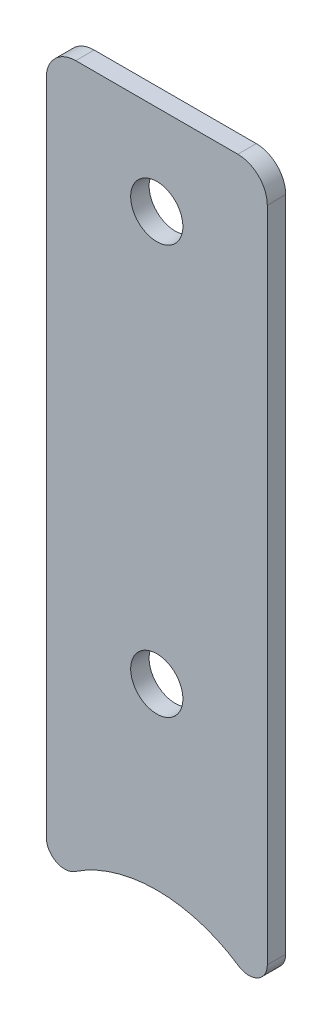
ISO-10303-21;
HEADER;
FILE_DESCRIPTION(('STEP AP214'),'2;1');
FILE_NAME('part.step','',(''),(''),'','','');
FILE_SCHEMA(('AUTOMOTIVE_DESIGN { 1 0 10303 214 1 1 1 1 }'));
ENDSEC;
DATA;
#1=APPLICATION_CONTEXT('core data for automotive mechanical design processes');
#2=APPLICATION_PROTOCOL_DEFINITION('international standard','automotive_design',2000,#1);
#3=PRODUCT_CONTEXT('',#1,'mechanical');
#4=PRODUCT('Part','Part','',(#3));
#5=PRODUCT_RELATED_PRODUCT_CATEGORY('part','',(#4));
#6=PRODUCT_DEFINITION_FORMATION('','',#4);
#7=PRODUCT_DEFINITION_CONTEXT('part definition',#1,'design');
#8=PRODUCT_DEFINITION('design','',#6,#7);
#9=PRODUCT_DEFINITION_SHAPE('','',#8);
#10=(LENGTH_UNIT() NAMED_UNIT(*) SI_UNIT(.MILLI.,.METRE.));
#11=(NAMED_UNIT(*) PLANE_ANGLE_UNIT() SI_UNIT($,.RADIAN.));
#12=(NAMED_UNIT(*) SI_UNIT($,.STERADIAN.) SOLID_ANGLE_UNIT());
#13=UNCERTAINTY_MEASURE_WITH_UNIT(LENGTH_MEASURE(1.E-05),#10,'distance_accuracy_value','');
#14=(GEOMETRIC_REPRESENTATION_CONTEXT(3) GLOBAL_UNCERTAINTY_ASSIGNED_CONTEXT((#13)) GLOBAL_UNIT_ASSIGNED_CONTEXT((#10,
#11,#12)) REPRESENTATION_CONTEXT('',''));
#15=CARTESIAN_POINT('',(0.,0.,0.));
#16=DIRECTION('',(0.,0.,1.));
#17=DIRECTION('',(1.,0.,0.));
#18=AXIS2_PLACEMENT_3D('',#15,#16,#17);
#19=CARTESIAN_POINT('',(9.525,0.,1.5875));
#20=DIRECTION('',(1.,0.,0.));
#21=DIRECTION('',(0.,1.,0.));
#22=AXIS2_PLACEMENT_3D('',#19,#20,#21);
#23=PLANE('',#22);
#24=DIRECTION('',(0.,-1.,0.));
#25=VECTOR('',#24,1.);
#26=CARTESIAN_POINT('',(9.525,0.,1.5875));
#27=LINE('',#26,#25);
#28=CARTESIAN_POINT('',(9.525,22.86,1.5875));
#29=VERTEX_POINT('',#28);
#30=CARTESIAN_POINT('',(9.52500000000001,-33.8402377969927,1.5875));
#31=VERTEX_POINT('',#30);
#32=EDGE_CURVE('E145',#29,#31,#27,.T.);
#33=ORIENTED_EDGE('',*,*,#32,.T.);
#34=DIRECTION('',(0.,0.,-1.));
#35=VECTOR('',#34,1.);
#36=CARTESIAN_POINT('',(9.52500000000001,-33.8402377969927,0.));
#37=LINE('',#36,#35);
#38=CARTESIAN_POINT('',(9.52500000000001,-33.8402377969927,0.));
#39=VERTEX_POINT('',#38);
#40=EDGE_CURVE('E79',#31,#39,#37,.T.);
#41=ORIENTED_EDGE('',*,*,#40,.T.);
#42=DIRECTION('',(0.,-1.,0.));
#43=VECTOR('',#42,1.);
#44=CARTESIAN_POINT('',(9.525,0.,0.));
#45=LINE('',#44,#43);
#46=CARTESIAN_POINT('',(9.525,22.86,0.));
#47=VERTEX_POINT('',#46);
#48=EDGE_CURVE('E150',#47,#39,#45,.T.);
#49=ORIENTED_EDGE('',*,*,#48,.F.);
#50=DIRECTION('',(0.,0.,-1.));
#51=VECTOR('',#50,1.);
#52=CARTESIAN_POINT('',(9.525,22.86,1.5875));
#53=LINE('',#52,#51);
#54=EDGE_CURVE('E162',#47,#29,#53,.F.);
#55=ORIENTED_EDGE('',*,*,#54,.T.);
#56=EDGE_LOOP('',(#33,#41,#49,#55));
#57=FACE_BOUND('',#56,.T.);
#58=ADVANCED_FACE('F56',(#57),#23,.T.);
#59=CARTESIAN_POINT('',(0.,25.4,1.5875));
#60=DIRECTION('',(0.,1.,0.));
#61=DIRECTION('',(-1.,0.,0.));
#62=AXIS2_PLACEMENT_3D('',#59,#60,#61);
#63=PLANE('',#62);
#64=DIRECTION('',(1.,0.,0.));
#65=VECTOR('',#64,1.);
#66=CARTESIAN_POINT('',(0.,25.4,0.));
#67=LINE('',#66,#65);
#68=CARTESIAN_POINT('',(-6.985,25.4,0.));
#69=VERTEX_POINT('',#68);
#70=CARTESIAN_POINT('',(6.985,25.4,0.));
#71=VERTEX_POINT('',#70);
#72=EDGE_CURVE('E146',#69,#71,#67,.T.);
#73=ORIENTED_EDGE('',*,*,#72,.F.);
#74=DIRECTION('',(0.,0.,-1.));
#75=VECTOR('',#74,1.);
#76=CARTESIAN_POINT('',(-6.985,25.4,1.5875));
#77=LINE('',#76,#75);
#78=CARTESIAN_POINT('',(-6.985,25.4,1.5875));
#79=VERTEX_POINT('',#78);
#80=EDGE_CURVE('E130',#69,#79,#77,.F.);
#81=ORIENTED_EDGE('',*,*,#80,.T.);
#82=DIRECTION('',(1.,0.,0.));
#83=VECTOR('',#82,1.);
#84=CARTESIAN_POINT('',(0.,25.4,1.5875));
#85=LINE('',#84,#83);
#86=CARTESIAN_POINT('',(6.985,25.4,1.5875));
#87=VERTEX_POINT('',#86);
#88=EDGE_CURVE('E148',#79,#87,#85,.T.);
#89=ORIENTED_EDGE('',*,*,#88,.T.);
#90=DIRECTION('',(0.,0.,-1.));
#91=VECTOR('',#90,1.);
#92=CARTESIAN_POINT('',(6.985,25.4,1.5875));
#93=LINE('',#92,#91);
#94=EDGE_CURVE('E133',#87,#71,#93,.T.);
#95=ORIENTED_EDGE('',*,*,#94,.T.);
#96=EDGE_LOOP('',(#73,#81,#89,#95));
#97=FACE_BOUND('',#96,.T.);
#98=ADVANCED_FACE('F199',(#97),#63,.T.);
#99=CARTESIAN_POINT('',(-9.525,0.,1.5875));
#100=DIRECTION('',(1.,0.,0.));
#101=DIRECTION('',(0.,1.,0.));
#102=AXIS2_PLACEMENT_3D('',#99,#100,#101);
#103=PLANE('',#102);
#104=DIRECTION('',(0.,-1.,0.));
#105=VECTOR('',#104,1.);
#106=CARTESIAN_POINT('',(-9.525,0.,0.));
#107=LINE('',#106,#105);
#108=CARTESIAN_POINT('',(-9.525,22.86,0.));
#109=VERTEX_POINT('',#108);
#110=CARTESIAN_POINT('',(-9.525,-33.8402377969927,0.));
#111=VERTEX_POINT('',#110);
#112=EDGE_CURVE('E139',#109,#111,#107,.T.);
#113=ORIENTED_EDGE('',*,*,#112,.T.);
#114=DIRECTION('',(0.,0.,1.));
#115=VECTOR('',#114,1.);
#116=CARTESIAN_POINT('',(-9.525,-33.8402377969927,1.5875));
#117=LINE('',#116,#115);
#118=CARTESIAN_POINT('',(-9.525,-33.8402377969927,1.5875));
#119=VERTEX_POINT('',#118);
#120=EDGE_CURVE('E12',#111,#119,#117,.T.);
#121=ORIENTED_EDGE('',*,*,#120,.T.);
#122=DIRECTION('',(0.,-1.,0.));
#123=VECTOR('',#122,1.);
#124=CARTESIAN_POINT('',(-9.525,0.,1.5875));
#125=LINE('',#124,#123);
#126=CARTESIAN_POINT('',(-9.525,22.86,1.5875));
#127=VERTEX_POINT('',#126);
#128=EDGE_CURVE('E142',#127,#119,#125,.T.);
#129=ORIENTED_EDGE('',*,*,#128,.F.);
#130=DIRECTION('',(0.,0.,-1.));
#131=VECTOR('',#130,1.);
#132=CARTESIAN_POINT('',(-9.525,22.86,0.));
#133=LINE('',#132,#131);
#134=EDGE_CURVE('E129',#127,#109,#133,.T.);
#135=ORIENTED_EDGE('',*,*,#134,.T.);
#136=EDGE_LOOP('',(#113,#121,#129,#135));
#137=FACE_BOUND('',#136,.T.);
#138=ADVANCED_FACE('F138',(#137),#103,.F.);
#139=CARTESIAN_POINT('',(0.,0.,1.5875));
#140=DIRECTION('',(0.,0.,1.));
#141=DIRECTION('',(1.,0.,0.));
#142=AXIS2_PLACEMENT_3D('',#139,#140,#141);
#143=PLANE('',#142);
#144=CARTESIAN_POINT('',(0.,17.6276,1.5875));
#145=DIRECTION('',(0.,0.,1.));
#146=DIRECTION('',(1.,0.,0.));
#147=AXIS2_PLACEMENT_3D('',#144,#145,#146);
#148=CIRCLE('',#147,2.24999999999999);
#149=CARTESIAN_POINT('',(2.24999999999999,17.6276,1.5875));
#150=VERTEX_POINT('',#149);
#151=EDGE_CURVE('E184',#150,#150,#148,.T.);
#152=ORIENTED_EDGE('',*,*,#151,.F.);
#153=EDGE_LOOP('',(#152));
#154=FACE_BOUND('',#153,.T.);
#155=CARTESIAN_POINT('',(0.,-17.6276,1.5875));
#156=DIRECTION('',(0.,0.,1.));
#157=DIRECTION('',(1.,0.,0.));
#158=AXIS2_PLACEMENT_3D('',#155,#156,#157);
#159=CIRCLE('',#158,2.24999999999999);
#160=CARTESIAN_POINT('',(2.24999999999999,-17.6276,1.5875));
#161=VERTEX_POINT('',#160);
#162=EDGE_CURVE('E205',#161,#161,#159,.T.);
#163=ORIENTED_EDGE('',*,*,#162,.F.);
#164=EDGE_LOOP('',(#163));
#165=FACE_BOUND('',#164,.T.);
#166=CARTESIAN_POINT('',(0.,-45.72,1.5875));
#167=DIRECTION('',(0.,0.,1.));
#168=DIRECTION('',(1.,0.,0.));
#169=AXIS2_PLACEMENT_3D('',#166,#167,#168);
#170=CIRCLE('',#169,12.7);
#171=CARTESIAN_POINT('',(7.05555555555556,-35.1602113751047,1.5875));
#172=VERTEX_POINT('',#171);
#173=CARTESIAN_POINT('',(-7.05555555555556,-35.1602113751047,1.5875));
#174=VERTEX_POINT('',#173);
#175=EDGE_CURVE('E185',#172,#174,#170,.T.);
#176=ORIENTED_EDGE('',*,*,#175,.F.);
#177=CARTESIAN_POINT('',(7.93750000000001,-33.8402377969927,1.5875));
#178=DIRECTION('',(0.,0.,1.));
#179=DIRECTION('',(1.,0.,0.));
#180=AXIS2_PLACEMENT_3D('',#177,#178,#179);
#181=CIRCLE('',#180,1.5875);
#182=EDGE_CURVE('E171',#172,#31,#181,.T.);
#183=ORIENTED_EDGE('',*,*,#182,.T.);
#184=ORIENTED_EDGE('',*,*,#32,.F.);
#185=CARTESIAN_POINT('',(6.985,22.86,1.5875));
#186=DIRECTION('',(0.,0.,1.));
#187=DIRECTION('',(1.,0.,0.));
#188=AXIS2_PLACEMENT_3D('',#185,#186,#187);
#189=CIRCLE('',#188,2.54);
#190=EDGE_CURVE('E158',#29,#87,#189,.T.);
#191=ORIENTED_EDGE('',*,*,#190,.T.);
#192=ORIENTED_EDGE('',*,*,#88,.F.);
#193=CARTESIAN_POINT('',(-6.985,22.86,1.5875));
#194=DIRECTION('',(0.,0.,1.));
#195=DIRECTION('',(1.,0.,0.));
#196=AXIS2_PLACEMENT_3D('',#193,#194,#195);
#197=CIRCLE('',#196,2.54);
#198=EDGE_CURVE('E160',#79,#127,#197,.T.);
#199=ORIENTED_EDGE('',*,*,#198,.T.);
#200=ORIENTED_EDGE('',*,*,#128,.T.);
#201=CARTESIAN_POINT('',(-7.9375,-33.8402377969927,1.5875));
#202=DIRECTION('',(0.,0.,1.));
#203=DIRECTION('',(1.,0.,0.));
#204=AXIS2_PLACEMENT_3D('',#201,#202,#203);
#205=CIRCLE('',#204,1.5875);
#206=EDGE_CURVE('E169',#119,#174,#205,.T.);
#207=ORIENTED_EDGE('',*,*,#206,.T.);
#208=EDGE_LOOP('',(#176,#183,#184,#191,#192,#199,#200,#207));
#209=FACE_BOUND('',#208,.T.);
#210=ADVANCED_FACE('F190',(#154,#165,#209),#143,.T.);
#211=CARTESIAN_POINT('',(0.,0.,0.));
#212=DIRECTION('',(0.,0.,1.));
#213=DIRECTION('',(1.,0.,0.));
#214=AXIS2_PLACEMENT_3D('',#211,#212,#213);
#215=PLANE('',#214);
#216=CARTESIAN_POINT('',(0.,17.6276,0.));
#217=DIRECTION('',(0.,0.,1.));
#218=DIRECTION('',(1.,0.,0.));
#219=AXIS2_PLACEMENT_3D('',#216,#217,#218);
#220=CIRCLE('',#219,2.25);
#221=CARTESIAN_POINT('',(2.25,17.6276,0.));
#222=VERTEX_POINT('',#221);
#223=EDGE_CURVE('E209',#222,#222,#220,.T.);
#224=ORIENTED_EDGE('',*,*,#223,.T.);
#225=EDGE_LOOP('',(#224));
#226=FACE_BOUND('',#225,.T.);
#227=CARTESIAN_POINT('',(0.,-17.6276,0.));
#228=DIRECTION('',(0.,0.,1.));
#229=DIRECTION('',(1.,0.,0.));
#230=AXIS2_PLACEMENT_3D('',#227,#228,#229);
#231=CIRCLE('',#230,2.25);
#232=CARTESIAN_POINT('',(2.25,-17.6276,0.));
#233=VERTEX_POINT('',#232);
#234=EDGE_CURVE('E203',#233,#233,#231,.T.);
#235=ORIENTED_EDGE('',*,*,#234,.T.);
#236=EDGE_LOOP('',(#235));
#237=FACE_BOUND('',#236,.T.);
#238=ORIENTED_EDGE('',*,*,#48,.T.);
#239=CARTESIAN_POINT('',(7.93750000000001,-33.8402377969927,0.));
#240=DIRECTION('',(0.,0.,1.));
#241=DIRECTION('',(1.,0.,0.));
#242=AXIS2_PLACEMENT_3D('',#239,#240,#241);
#243=CIRCLE('',#242,1.5875);
#244=CARTESIAN_POINT('',(7.05555555555556,-35.1602113751047,0.));
#245=VERTEX_POINT('',#244);
#246=EDGE_CURVE('E64',#39,#245,#243,.F.);
#247=ORIENTED_EDGE('',*,*,#246,.T.);
#248=CARTESIAN_POINT('',(0.,-45.72,0.));
#249=DIRECTION('',(0.,0.,1.));
#250=DIRECTION('',(1.,0.,0.));
#251=AXIS2_PLACEMENT_3D('',#248,#249,#250);
#252=CIRCLE('',#251,12.7);
#253=CARTESIAN_POINT('',(-7.05555555555556,-35.1602113751047,0.));
#254=VERTEX_POINT('',#253);
#255=EDGE_CURVE('E176',#245,#254,#252,.T.);
#256=ORIENTED_EDGE('',*,*,#255,.T.);
#257=CARTESIAN_POINT('',(-7.9375,-33.8402377969927,0.));
#258=DIRECTION('',(0.,0.,1.));
#259=DIRECTION('',(1.,0.,0.));
#260=AXIS2_PLACEMENT_3D('',#257,#258,#259);
#261=CIRCLE('',#260,1.5875);
#262=EDGE_CURVE('E71',#254,#111,#261,.F.);
#263=ORIENTED_EDGE('',*,*,#262,.T.);
#264=ORIENTED_EDGE('',*,*,#112,.F.);
#265=CARTESIAN_POINT('',(-6.985,22.86,0.));
#266=DIRECTION('',(0.,0.,1.));
#267=DIRECTION('',(1.,0.,0.));
#268=AXIS2_PLACEMENT_3D('',#265,#266,#267);
#269=CIRCLE('',#268,2.54);
#270=EDGE_CURVE('E125',#109,#69,#269,.F.);
#271=ORIENTED_EDGE('',*,*,#270,.T.);
#272=ORIENTED_EDGE('',*,*,#72,.T.);
#273=CARTESIAN_POINT('',(6.985,22.86,0.));
#274=DIRECTION('',(0.,0.,1.));
#275=DIRECTION('',(1.,0.,0.));
#276=AXIS2_PLACEMENT_3D('',#273,#274,#275);
#277=CIRCLE('',#276,2.54);
#278=EDGE_CURVE('E134',#71,#47,#277,.F.);
#279=ORIENTED_EDGE('',*,*,#278,.T.);
#280=EDGE_LOOP('',(#238,#247,#256,#263,#264,#271,#272,#279));
#281=FACE_BOUND('',#280,.T.);
#282=ADVANCED_FACE('F144',(#226,#237,#281),#215,.F.);
#283=CARTESIAN_POINT('',(0.,-17.6276,1.5875));
#284=DIRECTION('',(0.,0.,1.));
#285=DIRECTION('',(1.,0.,0.));
#286=AXIS2_PLACEMENT_3D('',#283,#284,#285);
#287=CYLINDRICAL_SURFACE('',#286,2.24999999999999);
#288=ORIENTED_EDGE('',*,*,#234,.F.);
#289=EDGE_LOOP('',(#288));
#290=FACE_BOUND('',#289,.T.);
#291=ORIENTED_EDGE('',*,*,#162,.T.);
#292=EDGE_LOOP('',(#291));
#293=FACE_BOUND('',#292,.T.);
#294=ADVANCED_FACE('F242',(#290,#293),#287,.F.);
#295=CARTESIAN_POINT('',(0.,17.6276,1.5875));
#296=DIRECTION('',(0.,0.,1.));
#297=DIRECTION('',(1.,0.,0.));
#298=AXIS2_PLACEMENT_3D('',#295,#296,#297);
#299=CYLINDRICAL_SURFACE('',#298,2.24999999999999);
#300=ORIENTED_EDGE('',*,*,#223,.F.);
#301=EDGE_LOOP('',(#300));
#302=FACE_BOUND('',#301,.T.);
#303=ORIENTED_EDGE('',*,*,#151,.T.);
#304=EDGE_LOOP('',(#303));
#305=FACE_BOUND('',#304,.T.);
#306=ADVANCED_FACE('F231',(#302,#305),#299,.F.);
#307=CARTESIAN_POINT('',(-6.985,22.86,1.5875));
#308=DIRECTION('',(0.,0.,1.));
#309=DIRECTION('',(1.,0.,0.));
#310=AXIS2_PLACEMENT_3D('',#307,#308,#309);
#311=CYLINDRICAL_SURFACE('',#310,2.54);
#312=ORIENTED_EDGE('',*,*,#198,.F.);
#313=ORIENTED_EDGE('',*,*,#80,.F.);
#314=ORIENTED_EDGE('',*,*,#270,.F.);
#315=ORIENTED_EDGE('',*,*,#134,.F.);
#316=EDGE_LOOP('',(#312,#313,#314,#315));
#317=FACE_BOUND('',#316,.T.);
#318=ADVANCED_FACE('F128',(#317),#311,.T.);
#319=CARTESIAN_POINT('',(6.985,22.86,1.5875));
#320=DIRECTION('',(0.,0.,-1.));
#321=DIRECTION('',(-1.,0.,0.));
#322=AXIS2_PLACEMENT_3D('',#319,#320,#321);
#323=CYLINDRICAL_SURFACE('',#322,2.54);
#324=ORIENTED_EDGE('',*,*,#190,.F.);
#325=ORIENTED_EDGE('',*,*,#54,.F.);
#326=ORIENTED_EDGE('',*,*,#278,.F.);
#327=ORIENTED_EDGE('',*,*,#94,.F.);
#328=EDGE_LOOP('',(#324,#325,#326,#327));
#329=FACE_BOUND('',#328,.T.);
#330=ADVANCED_FACE('F194',(#329),#323,.T.);
#331=CARTESIAN_POINT('',(0.,-45.72,0.));
#332=DIRECTION('',(0.,0.,1.));
#333=DIRECTION('',(1.,0.,0.));
#334=AXIS2_PLACEMENT_3D('',#331,#332,#333);
#335=CYLINDRICAL_SURFACE('',#334,12.7);
#336=ORIENTED_EDGE('',*,*,#255,.F.);
#337=DIRECTION('',(0.,0.,1.));
#338=VECTOR('',#337,1.);
#339=CARTESIAN_POINT('',(7.05555555555556,-35.1602113751047,0.));
#340=LINE('',#339,#338);
#341=EDGE_CURVE('E166',#245,#172,#340,.T.);
#342=ORIENTED_EDGE('',*,*,#341,.T.);
#343=ORIENTED_EDGE('',*,*,#175,.T.);
#344=DIRECTION('',(0.,0.,1.));
#345=VECTOR('',#344,1.);
#346=CARTESIAN_POINT('',(-7.05555555555555,-35.1602113751047,0.));
#347=LINE('',#346,#345);
#348=EDGE_CURVE('E164',#174,#254,#347,.F.);
#349=ORIENTED_EDGE('',*,*,#348,.T.);
#350=EDGE_LOOP('',(#336,#342,#343,#349));
#351=FACE_BOUND('',#350,.T.);
#352=ADVANCED_FACE('F180',(#351),#335,.F.);
#353=CARTESIAN_POINT('',(7.93750000000001,-33.8402377969927,0.));
#354=DIRECTION('',(0.,0.,1.));
#355=DIRECTION('',(1.,0.,0.));
#356=AXIS2_PLACEMENT_3D('',#353,#354,#355);
#357=CYLINDRICAL_SURFACE('',#356,1.5875);
#358=ORIENTED_EDGE('',*,*,#246,.F.);
#359=ORIENTED_EDGE('',*,*,#40,.F.);
#360=ORIENTED_EDGE('',*,*,#182,.F.);
#361=ORIENTED_EDGE('',*,*,#341,.F.);
#362=EDGE_LOOP('',(#358,#359,#360,#361));
#363=FACE_BOUND('',#362,.T.);
#364=ADVANCED_FACE('F187',(#363),#357,.T.);
#365=CARTESIAN_POINT('',(-7.9375,-33.8402377969927,0.));
#366=DIRECTION('',(0.,0.,1.));
#367=DIRECTION('',(1.,0.,0.));
#368=AXIS2_PLACEMENT_3D('',#365,#366,#367);
#369=CYLINDRICAL_SURFACE('',#368,1.5875);
#370=ORIENTED_EDGE('',*,*,#262,.F.);
#371=ORIENTED_EDGE('',*,*,#348,.F.);
#372=ORIENTED_EDGE('',*,*,#206,.F.);
#373=ORIENTED_EDGE('',*,*,#120,.F.);
#374=EDGE_LOOP('',(#370,#371,#372,#373));
#375=FACE_BOUND('',#374,.T.);
#376=ADVANCED_FACE('F58',(#375),#369,.T.);
#377=CLOSED_SHELL('',(#58,#98,#138,#210,#282,#294,#306,#318,#330,#352,#364,#376));
#378=MANIFOLD_SOLID_BREP('B2',#377);
#379=ADVANCED_BREP_SHAPE_REPRESENTATION('',(#18,#378),#14);
#380=SHAPE_DEFINITION_REPRESENTATION(#9,#379);
ENDSEC;
END-ISO-10303-21;
